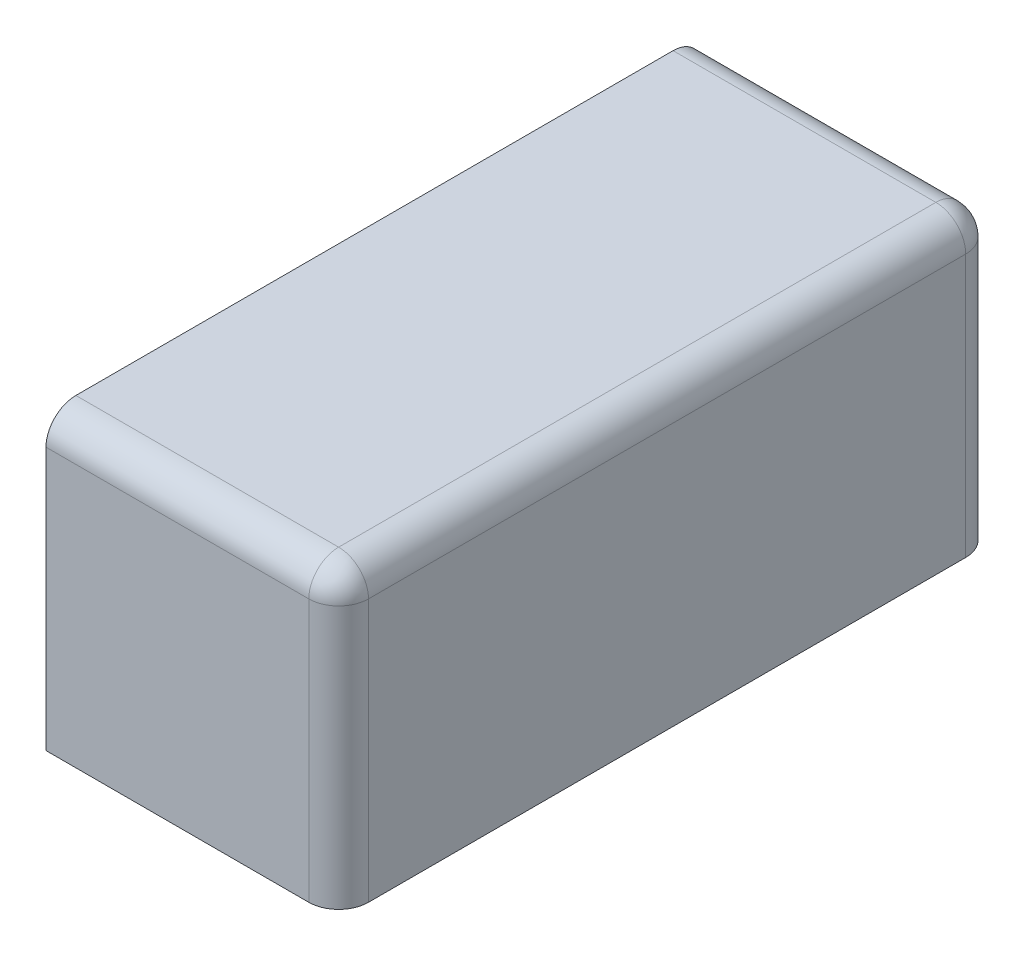
ISO-10303-21;
HEADER;
FILE_DESCRIPTION(('STEP AP214'),'2;1');
FILE_NAME('part.step','',(''),(''),'','','');
FILE_SCHEMA(('AUTOMOTIVE_DESIGN { 1 0 10303 214 1 1 1 1 }'));
ENDSEC;
DATA;
#1=APPLICATION_CONTEXT('core data for automotive mechanical design processes');
#2=APPLICATION_PROTOCOL_DEFINITION('international standard','automotive_design',2000,#1);
#3=PRODUCT_CONTEXT('',#1,'mechanical');
#4=PRODUCT('Part','Part','',(#3));
#5=PRODUCT_RELATED_PRODUCT_CATEGORY('part','',(#4));
#6=PRODUCT_DEFINITION_FORMATION('','',#4);
#7=PRODUCT_DEFINITION_CONTEXT('part definition',#1,'design');
#8=PRODUCT_DEFINITION('design','',#6,#7);
#9=PRODUCT_DEFINITION_SHAPE('','',#8);
#10=(LENGTH_UNIT() NAMED_UNIT(*) SI_UNIT(.MILLI.,.METRE.));
#11=(NAMED_UNIT(*) PLANE_ANGLE_UNIT() SI_UNIT($,.RADIAN.));
#12=(NAMED_UNIT(*) SI_UNIT($,.STERADIAN.) SOLID_ANGLE_UNIT());
#13=UNCERTAINTY_MEASURE_WITH_UNIT(LENGTH_MEASURE(1.E-05),#10,'distance_accuracy_value','');
#14=(GEOMETRIC_REPRESENTATION_CONTEXT(3) GLOBAL_UNCERTAINTY_ASSIGNED_CONTEXT((#13)) GLOBAL_UNIT_ASSIGNED_CONTEXT((#10,
#11,#12)) REPRESENTATION_CONTEXT('',''));
#15=CARTESIAN_POINT('',(0.,0.,0.));
#16=DIRECTION('',(0.,0.,1.));
#17=DIRECTION('',(1.,0.,0.));
#18=AXIS2_PLACEMENT_3D('',#15,#16,#17);
#19=CARTESIAN_POINT('',(0.,0.,22.));
#20=DIRECTION('',(-1.,0.,0.));
#21=DIRECTION('',(0.,-1.,0.));
#22=AXIS2_PLACEMENT_3D('',#19,#20,#21);
#23=PLANE('',#22);
#24=DIRECTION('',(0.,0.,-1.));
#25=VECTOR('',#24,1.);
#26=CARTESIAN_POINT('',(0.,0.,22.));
#27=LINE('',#26,#25);
#28=CARTESIAN_POINT('',(0.,0.,21.));
#29=VERTEX_POINT('',#28);
#30=CARTESIAN_POINT('',(0.,0.,1.));
#31=VERTEX_POINT('',#30);
#32=EDGE_CURVE('E124',#29,#31,#27,.T.);
#33=ORIENTED_EDGE('',*,*,#32,.T.);
#34=DIRECTION('',(0.,1.,0.));
#35=VECTOR('',#34,1.);
#36=CARTESIAN_POINT('',(0.,0.,1.));
#37=LINE('',#36,#35);
#38=CARTESIAN_POINT('',(0.,8.8,1.));
#39=VERTEX_POINT('',#38);
#40=EDGE_CURVE('E168',#31,#39,#37,.T.);
#41=ORIENTED_EDGE('',*,*,#40,.T.);
#42=DIRECTION('',(0.,0.,-1.));
#43=VECTOR('',#42,1.);
#44=CARTESIAN_POINT('',(0.,8.8,22.));
#45=LINE('',#44,#43);
#46=CARTESIAN_POINT('',(0.,8.8,21.));
#47=VERTEX_POINT('',#46);
#48=EDGE_CURVE('E162',#39,#47,#45,.F.);
#49=ORIENTED_EDGE('',*,*,#48,.T.);
#50=DIRECTION('',(0.,1.,0.));
#51=VECTOR('',#50,1.);
#52=CARTESIAN_POINT('',(0.,0.,21.));
#53=LINE('',#52,#51);
#54=EDGE_CURVE('E165',#47,#29,#53,.F.);
#55=ORIENTED_EDGE('',*,*,#54,.T.);
#56=EDGE_LOOP('',(#33,#41,#49,#55));
#57=FACE_BOUND('',#56,.T.);
#58=ADVANCED_FACE('F39',(#57),#23,.F.);
#59=CARTESIAN_POINT('',(0.,9.8,22.));
#60=DIRECTION('',(0.,-1.,0.));
#61=DIRECTION('',(1.,0.,0.));
#62=AXIS2_PLACEMENT_3D('',#59,#60,#61);
#63=PLANE('',#62);
#64=DIRECTION('',(0.,0.,-1.));
#65=VECTOR('',#64,1.);
#66=CARTESIAN_POINT('',(-1.,9.8,22.));
#67=LINE('',#66,#65);
#68=CARTESIAN_POINT('',(-1.,9.8,21.));
#69=VERTEX_POINT('',#68);
#70=CARTESIAN_POINT('',(-1.,9.8,1.));
#71=VERTEX_POINT('',#70);
#72=EDGE_CURVE('E140',#69,#71,#67,.T.);
#73=ORIENTED_EDGE('',*,*,#72,.T.);
#74=DIRECTION('',(-1.,0.,0.));
#75=VECTOR('',#74,1.);
#76=CARTESIAN_POINT('',(0.,9.8,1.));
#77=LINE('',#76,#75);
#78=CARTESIAN_POINT('',(-9.8,9.8,1.));
#79=VERTEX_POINT('',#78);
#80=EDGE_CURVE('E146',#71,#79,#77,.T.);
#81=ORIENTED_EDGE('',*,*,#80,.T.);
#82=DIRECTION('',(0.,0.,-1.));
#83=VECTOR('',#82,1.);
#84=CARTESIAN_POINT('',(-9.8,9.8,22.));
#85=LINE('',#84,#83);
#86=CARTESIAN_POINT('',(-9.8,9.8,21.));
#87=VERTEX_POINT('',#86);
#88=EDGE_CURVE('E123',#87,#79,#85,.T.);
#89=ORIENTED_EDGE('',*,*,#88,.F.);
#90=DIRECTION('',(-1.,0.,0.));
#91=VECTOR('',#90,1.);
#92=CARTESIAN_POINT('',(0.,9.8,21.));
#93=LINE('',#92,#91);
#94=EDGE_CURVE('E143',#87,#69,#93,.F.);
#95=ORIENTED_EDGE('',*,*,#94,.T.);
#96=EDGE_LOOP('',(#73,#81,#89,#95));
#97=FACE_BOUND('',#96,.T.);
#98=ADVANCED_FACE('F214',(#97),#63,.F.);
#99=CARTESIAN_POINT('',(-9.8,0.,22.));
#100=DIRECTION('',(1.,0.,0.));
#101=DIRECTION('',(0.,0.,-1.));
#102=AXIS2_PLACEMENT_3D('',#99,#100,#101);
#103=PLANE('',#102);
#104=CARTESIAN_POINT('',(-9.8,4.4,11.));
#105=DIRECTION('',(-1.,0.,0.));
#106=DIRECTION('',(0.,0.,1.));
#107=AXIS2_PLACEMENT_3D('',#104,#105,#106);
#108=CIRCLE('',#107,1.5);
#109=CARTESIAN_POINT('',(-9.8,4.4,12.5));
#110=VERTEX_POINT('',#109);
#111=EDGE_CURVE('E399',#110,#110,#108,.T.);
#112=ORIENTED_EDGE('',*,*,#111,.F.);
#113=EDGE_LOOP('',(#112));
#114=FACE_BOUND('',#113,.T.);
#115=ORIENTED_EDGE('',*,*,#88,.T.);
#116=CARTESIAN_POINT('',(-9.8,8.8,1.));
#117=DIRECTION('',(1.,0.,0.));
#118=DIRECTION('',(0.,0.,-1.));
#119=AXIS2_PLACEMENT_3D('',#116,#117,#118);
#120=CIRCLE('',#119,1.);
#121=CARTESIAN_POINT('',(-9.8,8.8,0.));
#122=VERTEX_POINT('',#121);
#123=EDGE_CURVE('E153',#79,#122,#120,.F.);
#124=ORIENTED_EDGE('',*,*,#123,.T.);
#125=DIRECTION('',(0.,-1.,0.));
#126=VECTOR('',#125,1.);
#127=CARTESIAN_POINT('',(-9.8,0.,0.));
#128=LINE('',#127,#126);
#129=CARTESIAN_POINT('',(-9.8,0.,0.));
#130=VERTEX_POINT('',#129);
#131=EDGE_CURVE('E119',#122,#130,#128,.T.);
#132=ORIENTED_EDGE('',*,*,#131,.T.);
#133=DIRECTION('',(0.,0.,-1.));
#134=VECTOR('',#133,1.);
#135=CARTESIAN_POINT('',(-9.8,0.,22.));
#136=LINE('',#135,#134);
#137=CARTESIAN_POINT('',(-9.8,0.,22.));
#138=VERTEX_POINT('',#137);
#139=EDGE_CURVE('E115',#138,#130,#136,.T.);
#140=ORIENTED_EDGE('',*,*,#139,.F.);
#141=DIRECTION('',(0.,-1.,0.));
#142=VECTOR('',#141,1.);
#143=CARTESIAN_POINT('',(-9.8,0.,22.));
#144=LINE('',#143,#142);
#145=CARTESIAN_POINT('',(-9.8,8.8,22.));
#146=VERTEX_POINT('',#145);
#147=EDGE_CURVE('E105',#146,#138,#144,.T.);
#148=ORIENTED_EDGE('',*,*,#147,.F.);
#149=CARTESIAN_POINT('',(-9.8,8.8,21.));
#150=DIRECTION('',(1.,0.,0.));
#151=DIRECTION('',(0.,0.,-1.));
#152=AXIS2_PLACEMENT_3D('',#149,#150,#151);
#153=CIRCLE('',#152,1.);
#154=EDGE_CURVE('E150',#146,#87,#153,.F.);
#155=ORIENTED_EDGE('',*,*,#154,.T.);
#156=EDGE_LOOP('',(#115,#124,#132,#140,#148,#155));
#157=FACE_BOUND('',#156,.T.);
#158=ADVANCED_FACE('F117',(#114,#157),#103,.F.);
#159=CARTESIAN_POINT('',(0.,0.,22.));
#160=DIRECTION('',(0.,1.,0.));
#161=DIRECTION('',(0.,0.,1.));
#162=AXIS2_PLACEMENT_3D('',#159,#160,#161);
#163=PLANE('',#162);
#164=CARTESIAN_POINT('',(-5.4,0.,18.5));
#165=DIRECTION('',(0.,-1.,0.));
#166=DIRECTION('',(0.,0.,-1.));
#167=AXIS2_PLACEMENT_3D('',#164,#165,#166);
#168=CIRCLE('',#167,2.);
#169=CARTESIAN_POINT('',(-5.4,0.,16.5));
#170=VERTEX_POINT('',#169);
#171=EDGE_CURVE('E408',#170,#170,#168,.T.);
#172=ORIENTED_EDGE('',*,*,#171,.F.);
#173=EDGE_LOOP('',(#172));
#174=FACE_BOUND('',#173,.T.);
#175=CARTESIAN_POINT('',(-5.4,0.,3.5));
#176=DIRECTION('',(0.,-1.,0.));
#177=DIRECTION('',(0.,0.,-1.));
#178=AXIS2_PLACEMENT_3D('',#175,#176,#177);
#179=CIRCLE('',#178,2.);
#180=CARTESIAN_POINT('',(-5.4,0.,1.5));
#181=VERTEX_POINT('',#180);
#182=EDGE_CURVE('E411',#181,#181,#179,.T.);
#183=ORIENTED_EDGE('',*,*,#182,.F.);
#184=EDGE_LOOP('',(#183));
#185=FACE_BOUND('',#184,.T.);
#186=DIRECTION('',(1.,0.,0.));
#187=VECTOR('',#186,1.);
#188=CARTESIAN_POINT('',(0.,0.,0.));
#189=LINE('',#188,#187);
#190=CARTESIAN_POINT('',(-1.,0.,0.));
#191=VERTEX_POINT('',#190);
#192=EDGE_CURVE('E112',#130,#191,#189,.T.);
#193=ORIENTED_EDGE('',*,*,#192,.T.);
#194=CARTESIAN_POINT('',(-1.,0.,1.));
#195=DIRECTION('',(0.,1.,0.));
#196=DIRECTION('',(0.,0.,1.));
#197=AXIS2_PLACEMENT_3D('',#194,#195,#196);
#198=CIRCLE('',#197,1.);
#199=EDGE_CURVE('E173',#191,#31,#198,.F.);
#200=ORIENTED_EDGE('',*,*,#199,.T.);
#201=ORIENTED_EDGE('',*,*,#32,.F.);
#202=CARTESIAN_POINT('',(-1.,0.,21.));
#203=DIRECTION('',(0.,1.,0.));
#204=DIRECTION('',(0.,0.,1.));
#205=AXIS2_PLACEMENT_3D('',#202,#203,#204);
#206=CIRCLE('',#205,1.);
#207=CARTESIAN_POINT('',(-1.,0.,22.));
#208=VERTEX_POINT('',#207);
#209=EDGE_CURVE('E63',#29,#208,#206,.F.);
#210=ORIENTED_EDGE('',*,*,#209,.T.);
#211=DIRECTION('',(1.,0.,0.));
#212=VECTOR('',#211,1.);
#213=CARTESIAN_POINT('',(0.,0.,22.));
#214=LINE('',#213,#212);
#215=EDGE_CURVE('E108',#138,#208,#214,.T.);
#216=ORIENTED_EDGE('',*,*,#215,.F.);
#217=ORIENTED_EDGE('',*,*,#139,.T.);
#218=EDGE_LOOP('',(#193,#200,#201,#210,#216,#217));
#219=FACE_BOUND('',#218,.T.);
#220=ADVANCED_FACE('F126',(#174,#185,#219),#163,.F.);
#221=CARTESIAN_POINT('',(0.,0.,22.));
#222=DIRECTION('',(0.,0.,1.));
#223=DIRECTION('',(1.,0.,0.));
#224=AXIS2_PLACEMENT_3D('',#221,#222,#223);
#225=PLANE('',#224);
#226=DIRECTION('',(0.,1.,0.));
#227=VECTOR('',#226,1.);
#228=CARTESIAN_POINT('',(-1.,9.8,22.));
#229=LINE('',#228,#227);
#230=CARTESIAN_POINT('',(-1.,8.8,22.));
#231=VERTEX_POINT('',#230);
#232=EDGE_CURVE('E49',#208,#231,#229,.T.);
#233=ORIENTED_EDGE('',*,*,#232,.T.);
#234=DIRECTION('',(-1.,0.,0.));
#235=VECTOR('',#234,1.);
#236=CARTESIAN_POINT('',(-9.8,8.8,22.));
#237=LINE('',#236,#235);
#238=EDGE_CURVE('E11',#231,#146,#237,.T.);
#239=ORIENTED_EDGE('',*,*,#238,.T.);
#240=ORIENTED_EDGE('',*,*,#147,.T.);
#241=ORIENTED_EDGE('',*,*,#215,.T.);
#242=EDGE_LOOP('',(#233,#239,#240,#241));
#243=FACE_BOUND('',#242,.T.);
#244=ADVANCED_FACE('F107',(#243),#225,.T.);
#245=CARTESIAN_POINT('',(0.,0.,0.));
#246=DIRECTION('',(0.,0.,1.));
#247=DIRECTION('',(1.,0.,0.));
#248=AXIS2_PLACEMENT_3D('',#245,#246,#247);
#249=PLANE('',#248);
#250=ORIENTED_EDGE('',*,*,#131,.F.);
#251=DIRECTION('',(-1.,0.,0.));
#252=VECTOR('',#251,1.);
#253=CARTESIAN_POINT('',(0.,8.8,0.));
#254=LINE('',#253,#252);
#255=CARTESIAN_POINT('',(-1.,8.8,0.));
#256=VERTEX_POINT('',#255);
#257=EDGE_CURVE('E159',#122,#256,#254,.F.);
#258=ORIENTED_EDGE('',*,*,#257,.T.);
#259=DIRECTION('',(0.,1.,0.));
#260=VECTOR('',#259,1.);
#261=CARTESIAN_POINT('',(-1.,0.,0.));
#262=LINE('',#261,#260);
#263=EDGE_CURVE('E156',#256,#191,#262,.F.);
#264=ORIENTED_EDGE('',*,*,#263,.T.);
#265=ORIENTED_EDGE('',*,*,#192,.F.);
#266=EDGE_LOOP('',(#250,#258,#264,#265));
#267=FACE_BOUND('',#266,.T.);
#268=ADVANCED_FACE('F223',(#267),#249,.F.);
#269=CARTESIAN_POINT('',(-1.,0.,21.));
#270=DIRECTION('',(0.,-1.,0.));
#271=DIRECTION('',(1.,0.,0.));
#272=AXIS2_PLACEMENT_3D('',#269,#270,#271);
#273=CYLINDRICAL_SURFACE('',#272,1.);
#274=ORIENTED_EDGE('',*,*,#209,.F.);
#275=ORIENTED_EDGE('',*,*,#54,.F.);
#276=CARTESIAN_POINT('',(-1.,8.8,21.));
#277=DIRECTION('',(0.,1.,0.));
#278=DIRECTION('',(0.,0.,1.));
#279=AXIS2_PLACEMENT_3D('',#276,#277,#278);
#280=CIRCLE('',#279,1.);
#281=EDGE_CURVE('E43',#231,#47,#280,.T.);
#282=ORIENTED_EDGE('',*,*,#281,.F.);
#283=ORIENTED_EDGE('',*,*,#232,.F.);
#284=EDGE_LOOP('',(#274,#275,#282,#283));
#285=FACE_BOUND('',#284,.T.);
#286=ADVANCED_FACE('F41',(#285),#273,.T.);
#287=CARTESIAN_POINT('',(0.,8.8,21.));
#288=DIRECTION('',(1.,0.,0.));
#289=DIRECTION('',(0.,1.,0.));
#290=AXIS2_PLACEMENT_3D('',#287,#288,#289);
#291=CYLINDRICAL_SURFACE('',#290,1.);
#292=ORIENTED_EDGE('',*,*,#154,.F.);
#293=ORIENTED_EDGE('',*,*,#238,.F.);
#294=CARTESIAN_POINT('',(-1.,8.8,21.));
#295=DIRECTION('',(1.,0.,0.));
#296=DIRECTION('',(0.,1.,0.));
#297=AXIS2_PLACEMENT_3D('',#294,#295,#296);
#298=CIRCLE('',#297,1.);
#299=EDGE_CURVE('E194',#69,#231,#298,.T.);
#300=ORIENTED_EDGE('',*,*,#299,.F.);
#301=ORIENTED_EDGE('',*,*,#94,.F.);
#302=EDGE_LOOP('',(#292,#293,#300,#301));
#303=FACE_BOUND('',#302,.T.);
#304=ADVANCED_FACE('F219',(#303),#291,.T.);
#305=CARTESIAN_POINT('',(-1.,8.8,21.));
#306=DIRECTION('',(0.,0.,1.));
#307=DIRECTION('',(1.,0.,0.));
#308=AXIS2_PLACEMENT_3D('',#305,#306,#307);
#309=SPHERICAL_SURFACE('',#308,1.);
#310=ORIENTED_EDGE('',*,*,#299,.T.);
#311=ORIENTED_EDGE('',*,*,#281,.T.);
#312=CARTESIAN_POINT('',(-1.,8.8,21.));
#313=DIRECTION('',(0.,0.,1.));
#314=DIRECTION('',(1.,0.,0.));
#315=AXIS2_PLACEMENT_3D('',#312,#313,#314);
#316=CIRCLE('',#315,1.);
#317=EDGE_CURVE('E191',#69,#47,#316,.F.);
#318=ORIENTED_EDGE('',*,*,#317,.F.);
#319=EDGE_LOOP('',(#310,#311,#318));
#320=FACE_BOUND('',#319,.T.);
#321=ADVANCED_FACE('F203',(#320),#309,.T.);
#322=CARTESIAN_POINT('',(-1.,0.,1.));
#323=DIRECTION('',(0.,1.,0.));
#324=DIRECTION('',(-1.,0.,0.));
#325=AXIS2_PLACEMENT_3D('',#322,#323,#324);
#326=CYLINDRICAL_SURFACE('',#325,1.);
#327=ORIENTED_EDGE('',*,*,#199,.F.);
#328=ORIENTED_EDGE('',*,*,#263,.F.);
#329=CARTESIAN_POINT('',(-1.,8.8,1.));
#330=DIRECTION('',(0.,1.,0.));
#331=DIRECTION('',(0.,0.,1.));
#332=AXIS2_PLACEMENT_3D('',#329,#330,#331);
#333=CIRCLE('',#332,1.);
#334=EDGE_CURVE('E187',#39,#256,#333,.T.);
#335=ORIENTED_EDGE('',*,*,#334,.F.);
#336=ORIENTED_EDGE('',*,*,#40,.F.);
#337=EDGE_LOOP('',(#327,#328,#335,#336));
#338=FACE_BOUND('',#337,.T.);
#339=ADVANCED_FACE('F231',(#338),#326,.T.);
#340=CARTESIAN_POINT('',(-1.,8.8,22.));
#341=DIRECTION('',(0.,0.,-1.));
#342=DIRECTION('',(-1.,0.,0.));
#343=AXIS2_PLACEMENT_3D('',#340,#341,#342);
#344=CYLINDRICAL_SURFACE('',#343,1.);
#345=ORIENTED_EDGE('',*,*,#317,.T.);
#346=ORIENTED_EDGE('',*,*,#48,.F.);
#347=CARTESIAN_POINT('',(-1.,8.8,1.));
#348=DIRECTION('',(0.,0.,-1.));
#349=DIRECTION('',(-1.,0.,0.));
#350=AXIS2_PLACEMENT_3D('',#347,#348,#349);
#351=CIRCLE('',#350,1.);
#352=EDGE_CURVE('E182',#71,#39,#351,.T.);
#353=ORIENTED_EDGE('',*,*,#352,.F.);
#354=ORIENTED_EDGE('',*,*,#72,.F.);
#355=EDGE_LOOP('',(#345,#346,#353,#354));
#356=FACE_BOUND('',#355,.T.);
#357=ADVANCED_FACE('F209',(#356),#344,.T.);
#358=CARTESIAN_POINT('',(-1.,8.8,1.));
#359=DIRECTION('',(1.,0.,0.));
#360=DIRECTION('',(0.,0.,-1.));
#361=AXIS2_PLACEMENT_3D('',#358,#359,#360);
#362=SPHERICAL_SURFACE('',#361,1.);
#363=ORIENTED_EDGE('',*,*,#352,.T.);
#364=ORIENTED_EDGE('',*,*,#334,.T.);
#365=CARTESIAN_POINT('',(-1.,8.8,1.));
#366=DIRECTION('',(1.,0.,0.));
#367=DIRECTION('',(0.,1.,0.));
#368=AXIS2_PLACEMENT_3D('',#365,#366,#367);
#369=CIRCLE('',#368,1.);
#370=EDGE_CURVE('E178',#71,#256,#369,.F.);
#371=ORIENTED_EDGE('',*,*,#370,.F.);
#372=EDGE_LOOP('',(#363,#364,#371));
#373=FACE_BOUND('',#372,.T.);
#374=ADVANCED_FACE('F227',(#373),#362,.T.);
#375=CARTESIAN_POINT('',(0.,8.8,1.));
#376=DIRECTION('',(-1.,0.,0.));
#377=DIRECTION('',(0.,-1.,0.));
#378=AXIS2_PLACEMENT_3D('',#375,#376,#377);
#379=CYLINDRICAL_SURFACE('',#378,1.);
#380=ORIENTED_EDGE('',*,*,#370,.T.);
#381=ORIENTED_EDGE('',*,*,#257,.F.);
#382=ORIENTED_EDGE('',*,*,#123,.F.);
#383=ORIENTED_EDGE('',*,*,#80,.F.);
#384=EDGE_LOOP('',(#380,#381,#382,#383));
#385=FACE_BOUND('',#384,.T.);
#386=ADVANCED_FACE('F225',(#385),#379,.T.);
#387=CARTESIAN_POINT('',(-2.8,4.4,11.));
#388=DIRECTION('',(-1.,0.,0.));
#389=DIRECTION('',(0.,0.,1.));
#390=AXIS2_PLACEMENT_3D('',#387,#388,#389);
#391=CYLINDRICAL_SURFACE('',#390,1.5);
#392=CARTESIAN_POINT('',(-2.8,4.4,11.));
#393=DIRECTION('',(-1.,0.,0.));
#394=DIRECTION('',(0.,0.,1.));
#395=AXIS2_PLACEMENT_3D('',#392,#393,#394);
#396=CIRCLE('',#395,1.5);
#397=CARTESIAN_POINT('',(-2.8,4.4,12.5));
#398=VERTEX_POINT('',#397);
#399=EDGE_CURVE('E183',#398,#398,#396,.T.);
#400=ORIENTED_EDGE('',*,*,#399,.F.);
#401=EDGE_LOOP('',(#400));
#402=FACE_BOUND('',#401,.T.);
#403=ORIENTED_EDGE('',*,*,#111,.T.);
#404=EDGE_LOOP('',(#403));
#405=FACE_BOUND('',#404,.T.);
#406=ADVANCED_FACE('F249',(#402,#405),#391,.F.);
#407=CARTESIAN_POINT('',(-2.8,4.4,11.));
#408=DIRECTION('',(-1.,0.,0.));
#409=DIRECTION('',(0.,0.,1.));
#410=AXIS2_PLACEMENT_3D('',#407,#408,#409);
#411=PLANE('',#410);
#412=ORIENTED_EDGE('',*,*,#399,.T.);
#413=EDGE_LOOP('',(#412));
#414=FACE_BOUND('',#413,.T.);
#415=ADVANCED_FACE('F284',(#414),#411,.T.);
#416=CARTESIAN_POINT('',(-5.4,5.2,3.5));
#417=DIRECTION('',(0.,-1.,0.));
#418=DIRECTION('',(0.,0.,-1.));
#419=AXIS2_PLACEMENT_3D('',#416,#417,#418);
#420=CYLINDRICAL_SURFACE('',#419,2.);
#421=CARTESIAN_POINT('',(-5.4,5.2,3.5));
#422=DIRECTION('',(0.,-1.,0.));
#423=DIRECTION('',(0.,0.,-1.));
#424=AXIS2_PLACEMENT_3D('',#421,#422,#423);
#425=CIRCLE('',#424,2.);
#426=CARTESIAN_POINT('',(-5.4,5.2,1.5));
#427=VERTEX_POINT('',#426);
#428=EDGE_CURVE('E415',#427,#427,#425,.T.);
#429=ORIENTED_EDGE('',*,*,#428,.F.);
#430=EDGE_LOOP('',(#429));
#431=FACE_BOUND('',#430,.T.);
#432=ORIENTED_EDGE('',*,*,#182,.T.);
#433=EDGE_LOOP('',(#432));
#434=FACE_BOUND('',#433,.T.);
#435=ADVANCED_FACE('F292',(#431,#434),#420,.F.);
#436=CARTESIAN_POINT('',(-5.4,5.2,3.5));
#437=DIRECTION('',(0.,-1.,0.));
#438=DIRECTION('',(0.,0.,-1.));
#439=AXIS2_PLACEMENT_3D('',#436,#437,#438);
#440=PLANE('',#439);
#441=ORIENTED_EDGE('',*,*,#428,.T.);
#442=EDGE_LOOP('',(#441));
#443=FACE_BOUND('',#442,.T.);
#444=ADVANCED_FACE('F301',(#443),#440,.T.);
#445=CARTESIAN_POINT('',(-5.4,5.2,18.5));
#446=DIRECTION('',(0.,-1.,0.));
#447=DIRECTION('',(0.,0.,-1.));
#448=AXIS2_PLACEMENT_3D('',#445,#446,#447);
#449=CYLINDRICAL_SURFACE('',#448,2.);
#450=CARTESIAN_POINT('',(-5.4,5.2,18.5));
#451=DIRECTION('',(0.,-1.,0.));
#452=DIRECTION('',(0.,0.,-1.));
#453=AXIS2_PLACEMENT_3D('',#450,#451,#452);
#454=CIRCLE('',#453,2.);
#455=CARTESIAN_POINT('',(-5.4,5.2,16.5));
#456=VERTEX_POINT('',#455);
#457=EDGE_CURVE('E402',#456,#456,#454,.T.);
#458=ORIENTED_EDGE('',*,*,#457,.F.);
#459=EDGE_LOOP('',(#458));
#460=FACE_BOUND('',#459,.T.);
#461=ORIENTED_EDGE('',*,*,#171,.T.);
#462=EDGE_LOOP('',(#461));
#463=FACE_BOUND('',#462,.T.);
#464=ADVANCED_FACE('F309',(#460,#463),#449,.F.);
#465=CARTESIAN_POINT('',(-5.4,5.2,18.5));
#466=DIRECTION('',(0.,-1.,0.));
#467=DIRECTION('',(0.,0.,-1.));
#468=AXIS2_PLACEMENT_3D('',#465,#466,#467);
#469=PLANE('',#468);
#470=ORIENTED_EDGE('',*,*,#457,.T.);
#471=EDGE_LOOP('',(#470));
#472=FACE_BOUND('',#471,.T.);
#473=ADVANCED_FACE('F317',(#472),#469,.T.);
#474=CLOSED_SHELL('',(#58,#98,#158,#220,#244,#268,#286,#304,#321,#339,#357,#374,#386,#406,#415,
#435,#444,#464,#473));
#475=MANIFOLD_SOLID_BREP('B2',#474);
#476=ADVANCED_BREP_SHAPE_REPRESENTATION('',(#18,#475),#14);
#477=SHAPE_DEFINITION_REPRESENTATION(#9,#476);
ENDSEC;
END-ISO-10303-21;
